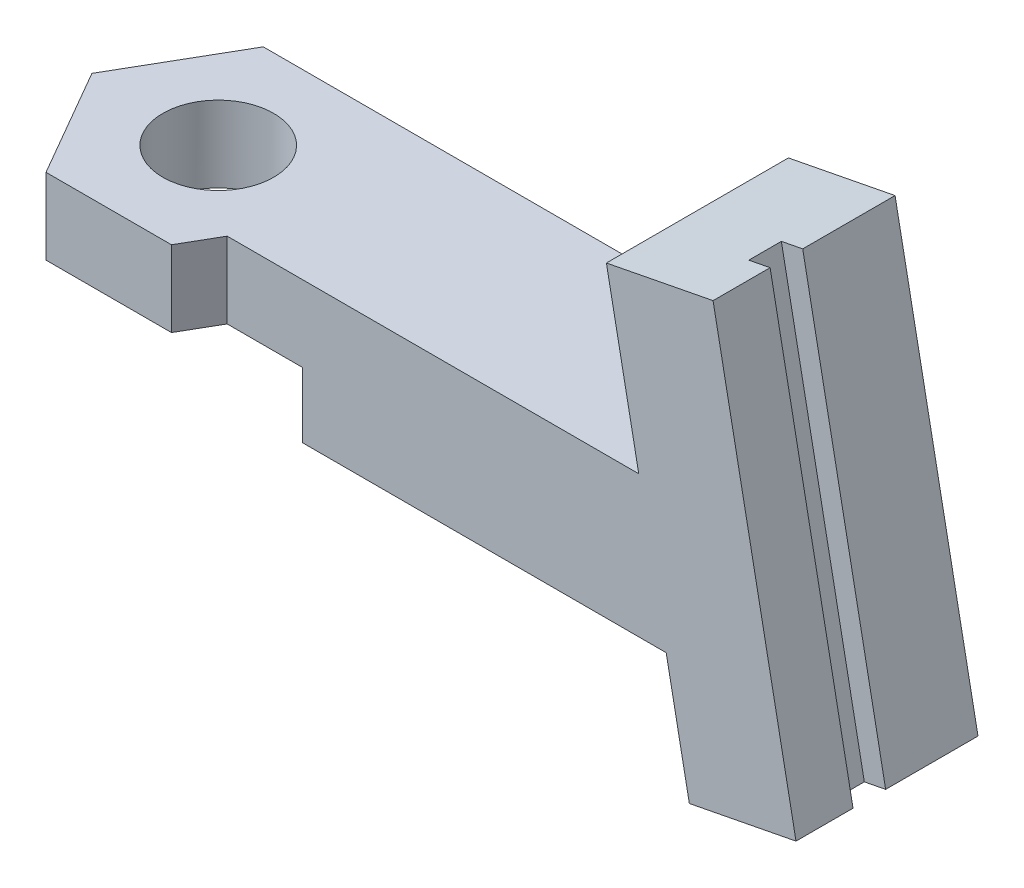
ISO-10303-21;
HEADER;
FILE_DESCRIPTION(('STEP AP214'),'2;1');
FILE_NAME('part.step','',(''),(''),'','','');
FILE_SCHEMA(('AUTOMOTIVE_DESIGN { 1 0 10303 214 1 1 1 1 }'));
ENDSEC;
DATA;
#1=APPLICATION_CONTEXT('core data for automotive mechanical design processes');
#2=APPLICATION_PROTOCOL_DEFINITION('international standard','automotive_design',2000,#1);
#3=PRODUCT_CONTEXT('',#1,'mechanical');
#4=PRODUCT('Part','Part','',(#3));
#5=PRODUCT_RELATED_PRODUCT_CATEGORY('part','',(#4));
#6=PRODUCT_DEFINITION_FORMATION('','',#4);
#7=PRODUCT_DEFINITION_CONTEXT('part definition',#1,'design');
#8=PRODUCT_DEFINITION('design','',#6,#7);
#9=PRODUCT_DEFINITION_SHAPE('','',#8);
#10=(LENGTH_UNIT() NAMED_UNIT(*) SI_UNIT(.MILLI.,.METRE.));
#11=(NAMED_UNIT(*) PLANE_ANGLE_UNIT() SI_UNIT($,.RADIAN.));
#12=(NAMED_UNIT(*) SI_UNIT($,.STERADIAN.) SOLID_ANGLE_UNIT());
#13=UNCERTAINTY_MEASURE_WITH_UNIT(LENGTH_MEASURE(1.E-05),#10,'distance_accuracy_value','');
#14=(GEOMETRIC_REPRESENTATION_CONTEXT(3) GLOBAL_UNCERTAINTY_ASSIGNED_CONTEXT((#13)) GLOBAL_UNIT_ASSIGNED_CONTEXT((#10,
#11,#12)) REPRESENTATION_CONTEXT('',''));
#15=CARTESIAN_POINT('',(0.,0.,0.));
#16=DIRECTION('',(0.,0.,1.));
#17=DIRECTION('',(1.,0.,0.));
#18=AXIS2_PLACEMENT_3D('',#15,#16,#17);
#19=CARTESIAN_POINT('',(2.88675134594813,-15.2752523165195,8.375));
#20=DIRECTION('',(0.866025403784439,0.,0.5));
#21=DIRECTION('',(0.5,0.,-0.866025403784439));
#22=AXIS2_PLACEMENT_3D('',#19,#20,#21);
#23=PLANE('',#22);
#24=DIRECTION('',(0.,1.,0.));
#25=VECTOR('',#24,1.);
#26=CARTESIAN_POINT('',(2.88675134594813,-15.2752523165195,8.375));
#27=LINE('',#26,#25);
#28=CARTESIAN_POINT('',(2.88675134594813,3.,8.375));
#29=VERTEX_POINT('',#28);
#30=CARTESIAN_POINT('',(2.88675134594813,6.5,8.375));
#31=VERTEX_POINT('',#30);
#32=EDGE_CURVE('E241',#29,#31,#27,.T.);
#33=ORIENTED_EDGE('',*,*,#32,.F.);
#34=DIRECTION('',(0.5,0.,-0.866025403784439));
#35=VECTOR('',#34,1.);
#36=CARTESIAN_POINT('',(2.88675134594813,3.,8.375));
#37=LINE('',#36,#35);
#38=CARTESIAN_POINT('',(3.82494553338127,3.,6.75));
#39=VERTEX_POINT('',#38);
#40=EDGE_CURVE('E195',#29,#39,#37,.T.);
#41=ORIENTED_EDGE('',*,*,#40,.T.);
#42=DIRECTION('',(0.,-1.,0.));
#43=VECTOR('',#42,1.);
#44=CARTESIAN_POINT('',(3.82494553338127,6.5,6.75));
#45=LINE('',#44,#43);
#46=CARTESIAN_POINT('',(3.82494553338127,6.5,6.75));
#47=VERTEX_POINT('',#46);
#48=EDGE_CURVE('E223',#47,#39,#45,.T.);
#49=ORIENTED_EDGE('',*,*,#48,.F.);
#50=DIRECTION('',(0.5,0.,-0.866025403784439));
#51=VECTOR('',#50,1.);
#52=CARTESIAN_POINT('',(2.88675134594813,6.5,8.375));
#53=LINE('',#52,#51);
#54=EDGE_CURVE('E233',#31,#47,#53,.T.);
#55=ORIENTED_EDGE('',*,*,#54,.F.);
#56=EDGE_LOOP('',(#33,#41,#49,#55));
#57=FACE_BOUND('',#56,.T.);
#58=ADVANCED_FACE('F36',(#57),#23,.T.);
#59=CARTESIAN_POINT('',(-2.88675134594813,-15.2752523165195,-1.625));
#60=DIRECTION('',(-0.866025403784439,0.,-0.5));
#61=DIRECTION('',(-0.5,0.,0.866025403784439));
#62=AXIS2_PLACEMENT_3D('',#59,#60,#61);
#63=PLANE('',#62);
#64=DIRECTION('',(0.,1.,0.));
#65=VECTOR('',#64,1.);
#66=CARTESIAN_POINT('',(-2.88675134594813,-15.2752523165195,-1.625));
#67=LINE('',#66,#65);
#68=CARTESIAN_POINT('',(-2.88675134594813,3.,-1.625));
#69=VERTEX_POINT('',#68);
#70=CARTESIAN_POINT('',(-2.88675134594813,6.5,-1.625));
#71=VERTEX_POINT('',#70);
#72=EDGE_CURVE('E224',#69,#71,#67,.T.);
#73=ORIENTED_EDGE('',*,*,#72,.F.);
#74=DIRECTION('',(-0.5,0.,0.866025403784439));
#75=VECTOR('',#74,1.);
#76=CARTESIAN_POINT('',(-2.88675134594813,3.,-1.625));
#77=LINE('',#76,#75);
#78=CARTESIAN_POINT('',(-5.77350269189626,3.,3.375));
#79=VERTEX_POINT('',#78);
#80=EDGE_CURVE('E192',#69,#79,#77,.T.);
#81=ORIENTED_EDGE('',*,*,#80,.T.);
#82=DIRECTION('',(0.,1.,0.));
#83=VECTOR('',#82,1.);
#84=CARTESIAN_POINT('',(-5.77350269189626,-15.2752523165195,3.375));
#85=LINE('',#84,#83);
#86=CARTESIAN_POINT('',(-5.77350269189626,6.5,3.375));
#87=VERTEX_POINT('',#86);
#88=EDGE_CURVE('E239',#79,#87,#85,.T.);
#89=ORIENTED_EDGE('',*,*,#88,.T.);
#90=DIRECTION('',(-0.5,0.,0.866025403784439));
#91=VECTOR('',#90,1.);
#92=CARTESIAN_POINT('',(-2.88675134594813,6.5,-1.625));
#93=LINE('',#92,#91);
#94=EDGE_CURVE('E220',#71,#87,#93,.T.);
#95=ORIENTED_EDGE('',*,*,#94,.F.);
#96=EDGE_LOOP('',(#73,#81,#89,#95));
#97=FACE_BOUND('',#96,.T.);
#98=ADVANCED_FACE('F327',(#97),#63,.T.);
#99=CARTESIAN_POINT('',(-2.88675134594813,-15.2752523165195,8.375));
#100=DIRECTION('',(0.,0.,1.));
#101=DIRECTION('',(1.,0.,0.));
#102=AXIS2_PLACEMENT_3D('',#99,#100,#101);
#103=PLANE('',#102);
#104=DIRECTION('',(0.,1.,0.));
#105=VECTOR('',#104,1.);
#106=CARTESIAN_POINT('',(-2.88675134594813,-15.2752523165195,8.375));
#107=LINE('',#106,#105);
#108=CARTESIAN_POINT('',(-2.88675134594813,3.,8.375));
#109=VERTEX_POINT('',#108);
#110=CARTESIAN_POINT('',(-2.88675134594813,6.5,8.375));
#111=VERTEX_POINT('',#110);
#112=EDGE_CURVE('E243',#109,#111,#107,.T.);
#113=ORIENTED_EDGE('',*,*,#112,.F.);
#114=DIRECTION('',(1.,0.,0.));
#115=VECTOR('',#114,1.);
#116=CARTESIAN_POINT('',(-2.88675134594813,3.,8.375));
#117=LINE('',#116,#115);
#118=EDGE_CURVE('E51',#109,#29,#117,.T.);
#119=ORIENTED_EDGE('',*,*,#118,.T.);
#120=ORIENTED_EDGE('',*,*,#32,.T.);
#121=DIRECTION('',(1.,0.,0.));
#122=VECTOR('',#121,1.);
#123=CARTESIAN_POINT('',(-2.88675134594813,6.5,8.375));
#124=LINE('',#123,#122);
#125=EDGE_CURVE('E230',#111,#31,#124,.T.);
#126=ORIENTED_EDGE('',*,*,#125,.F.);
#127=EDGE_LOOP('',(#113,#119,#120,#126));
#128=FACE_BOUND('',#127,.T.);
#129=ADVANCED_FACE('F321',(#128),#103,.T.);
#130=CARTESIAN_POINT('',(-5.77350269189626,-15.2752523165195,3.375));
#131=DIRECTION('',(-0.866025403784438,0.,0.5));
#132=DIRECTION('',(0.5,0.,0.866025403784439));
#133=AXIS2_PLACEMENT_3D('',#130,#131,#132);
#134=PLANE('',#133);
#135=ORIENTED_EDGE('',*,*,#88,.F.);
#136=DIRECTION('',(0.5,0.,0.866025403784439));
#137=VECTOR('',#136,1.);
#138=CARTESIAN_POINT('',(-5.77350269189626,3.,3.375));
#139=LINE('',#138,#137);
#140=EDGE_CURVE('E189',#79,#109,#139,.T.);
#141=ORIENTED_EDGE('',*,*,#140,.T.);
#142=ORIENTED_EDGE('',*,*,#112,.T.);
#143=DIRECTION('',(0.5,0.,0.866025403784439));
#144=VECTOR('',#143,1.);
#145=CARTESIAN_POINT('',(-5.77350269189626,6.5,3.375));
#146=LINE('',#145,#144);
#147=EDGE_CURVE('E227',#87,#111,#146,.T.);
#148=ORIENTED_EDGE('',*,*,#147,.F.);
#149=EDGE_LOOP('',(#135,#141,#142,#148));
#150=FACE_BOUND('',#149,.T.);
#151=ADVANCED_FACE('F311',(#150),#134,.T.);
#152=CARTESIAN_POINT('',(0.,-3.5,3.33561597332667));
#153=DIRECTION('',(0.,1.,0.));
#154=DIRECTION('',(0.,0.,1.));
#155=AXIS2_PLACEMENT_3D('',#152,#153,#154);
#156=CYLINDRICAL_SURFACE('',#155,2.55);
#157=CARTESIAN_POINT('',(0.,6.5,3.33561597332667));
#158=DIRECTION('',(0.,1.,0.));
#159=DIRECTION('',(0.,0.,1.));
#160=AXIS2_PLACEMENT_3D('',#157,#158,#159);
#161=CIRCLE('',#160,2.55);
#162=CARTESIAN_POINT('',(0.,6.5,5.88561597332667));
#163=VERTEX_POINT('',#162);
#164=EDGE_CURVE('E206',#163,#163,#161,.T.);
#165=ORIENTED_EDGE('',*,*,#164,.T.);
#166=EDGE_LOOP('',(#165));
#167=FACE_BOUND('',#166,.T.);
#168=CARTESIAN_POINT('',(0.,3.,3.33561597332667));
#169=DIRECTION('',(0.,-1.,0.));
#170=DIRECTION('',(0.,0.,-1.));
#171=AXIS2_PLACEMENT_3D('',#168,#169,#170);
#172=CIRCLE('',#171,2.55);
#173=CARTESIAN_POINT('',(0.,3.,0.78561597332667));
#174=VERTEX_POINT('',#173);
#175=EDGE_CURVE('E179',#174,#174,#172,.F.);
#176=ORIENTED_EDGE('',*,*,#175,.F.);
#177=EDGE_LOOP('',(#176));
#178=FACE_BOUND('',#177,.T.);
#179=ADVANCED_FACE('F308',(#167,#178),#156,.F.);
#180=CARTESIAN_POINT('',(21.2756841752307,14.1555211805119,-22.3589203380482));
#181=DIRECTION('',(-0.190808995376549,0.981627183447663,0.));
#182=DIRECTION('',(-0.981627183447663,-0.190808995376549,0.));
#183=AXIS2_PLACEMENT_3D('',#180,#181,#182);
#184=PLANE('',#183);
#185=DIRECTION('',(0.,0.,1.));
#186=VECTOR('',#185,1.);
#187=CARTESIAN_POINT('',(25.2021929090214,14.9187571620179,2.625));
#188=LINE('',#187,#186);
#189=CARTESIAN_POINT('',(25.2021929090214,14.9187571620179,2.625));
#190=VERTEX_POINT('',#189);
#191=CARTESIAN_POINT('',(25.2021929090214,14.9187571620179,4.125));
#192=VERTEX_POINT('',#191);
#193=EDGE_CURVE('E252',#190,#192,#188,.T.);
#194=ORIENTED_EDGE('',*,*,#193,.F.);
#195=DIRECTION('',(0.981627183447664,0.190808995376542,0.));
#196=VECTOR('',#195,1.);
#197=CARTESIAN_POINT('',(25.2021929090214,14.9187571620179,2.625));
#198=LINE('',#197,#196);
#199=CARTESIAN_POINT('',(26.183820092469,15.1095661573944,2.625));
#200=VERTEX_POINT('',#199);
#201=EDGE_CURVE('E247',#190,#200,#198,.T.);
#202=ORIENTED_EDGE('',*,*,#201,.T.);
#203=DIRECTION('',(0.,0.,1.));
#204=VECTOR('',#203,1.);
#205=CARTESIAN_POINT('',(26.183820092469,15.1095661573946,-22.3589203380482));
#206=LINE('',#205,#204);
#207=CARTESIAN_POINT('',(26.183820092469,15.1095661573946,-1.62500000000001));
#208=VERTEX_POINT('',#207);
#209=EDGE_CURVE('E282',#208,#200,#206,.T.);
#210=ORIENTED_EDGE('',*,*,#209,.F.);
#211=DIRECTION('',(0.981627183447663,0.190808995376549,0.));
#212=VECTOR('',#211,1.);
#213=CARTESIAN_POINT('',(26.183820092469,15.1095661573946,-1.62500000000001));
#214=LINE('',#213,#212);
#215=CARTESIAN_POINT('',(21.2756841752307,14.1555211805119,-1.625));
#216=VERTEX_POINT('',#215);
#217=EDGE_CURVE('E213',#216,#208,#214,.T.);
#218=ORIENTED_EDGE('',*,*,#217,.F.);
#219=DIRECTION('',(0.,0.,1.));
#220=VECTOR('',#219,1.);
#221=CARTESIAN_POINT('',(21.2756841752307,14.1555211805119,-22.3589203380482));
#222=LINE('',#221,#220);
#223=CARTESIAN_POINT('',(21.2756841752307,14.1555211805119,6.75));
#224=VERTEX_POINT('',#223);
#225=EDGE_CURVE('E278',#216,#224,#222,.T.);
#226=ORIENTED_EDGE('',*,*,#225,.T.);
#227=DIRECTION('',(0.981627183447663,0.190808995376549,0.));
#228=VECTOR('',#227,1.);
#229=CARTESIAN_POINT('',(21.2756841752307,14.1555211805119,6.75));
#230=LINE('',#229,#228);
#231=CARTESIAN_POINT('',(26.183820092469,15.1095661573946,6.75000000000001));
#232=VERTEX_POINT('',#231);
#233=EDGE_CURVE('E264',#224,#232,#230,.T.);
#234=ORIENTED_EDGE('',*,*,#233,.T.);
#235=CARTESIAN_POINT('',(26.183820092469,15.1095661573944,4.125));
#236=VERTEX_POINT('',#235);
#237=EDGE_CURVE('E285',#236,#232,#206,.T.);
#238=ORIENTED_EDGE('',*,*,#237,.F.);
#239=DIRECTION('',(0.981627183447664,0.190808995376542,0.));
#240=VECTOR('',#239,1.);
#241=CARTESIAN_POINT('',(25.2021929090214,14.9187571620179,4.125));
#242=LINE('',#241,#240);
#243=EDGE_CURVE('E250',#192,#236,#242,.T.);
#244=ORIENTED_EDGE('',*,*,#243,.F.);
#245=EDGE_LOOP('',(#194,#202,#210,#218,#226,#234,#238,#244));
#246=FACE_BOUND('',#245,.T.);
#247=ADVANCED_FACE('F310',(#246),#184,.T.);
#248=CARTESIAN_POINT('',(26.183820092469,15.1095661573946,-22.3589203380482));
#249=DIRECTION('',(0.981627183447663,0.190808995376549,0.));
#250=DIRECTION('',(-0.190808995376549,0.981627183447663,0.));
#251=AXIS2_PLACEMENT_3D('',#248,#249,#250);
#252=PLANE('',#251);
#253=ORIENTED_EDGE('',*,*,#209,.T.);
#254=DIRECTION('',(-0.190808995376542,0.981627183447665,0.));
#255=VECTOR('',#254,1.);
#256=CARTESIAN_POINT('',(30.5724269861295,-7.46785906190183,2.625));
#257=LINE('',#256,#255);
#258=CARTESIAN_POINT('',(29.9999999999999,-4.52297751155865,2.625));
#259=VERTEX_POINT('',#258);
#260=EDGE_CURVE('E262',#259,#200,#257,.T.);
#261=ORIENTED_EDGE('',*,*,#260,.F.);
#262=DIRECTION('',(0.,0.,1.));
#263=VECTOR('',#262,1.);
#264=CARTESIAN_POINT('',(30.,-4.52297751155863,-22.3589203380482));
#265=LINE('',#264,#263);
#266=CARTESIAN_POINT('',(30.,-4.52297751155863,-1.62500000000001));
#267=VERTEX_POINT('',#266);
#268=EDGE_CURVE('E286',#267,#259,#265,.T.);
#269=ORIENTED_EDGE('',*,*,#268,.F.);
#270=DIRECTION('',(0.190808995376549,-0.981627183447663,0.));
#271=VECTOR('',#270,1.);
#272=CARTESIAN_POINT('',(30.,-4.52297751155863,-1.62500000000001));
#273=LINE('',#272,#271);
#274=EDGE_CURVE('E210',#208,#267,#273,.T.);
#275=ORIENTED_EDGE('',*,*,#274,.F.);
#276=EDGE_LOOP('',(#253,#261,#269,#275));
#277=FACE_BOUND('',#276,.T.);
#278=ADVANCED_FACE('F318',(#277),#252,.T.);
#279=CARTESIAN_POINT('',(30.,-4.52297751155863,-22.3589203380482));
#280=DIRECTION('',(0.190808995376549,-0.981627183447663,0.));
#281=DIRECTION('',(0.981627183447663,0.190808995376549,0.));
#282=AXIS2_PLACEMENT_3D('',#279,#280,#281);
#283=PLANE('',#282);
#284=ORIENTED_EDGE('',*,*,#268,.T.);
#285=DIRECTION('',(-0.981627183447663,-0.190808995376549,0.));
#286=VECTOR('',#285,1.);
#287=CARTESIAN_POINT('',(30.,-4.52297751155863,2.625));
#288=LINE('',#287,#286);
#289=CARTESIAN_POINT('',(29.0183728165522,-4.7137865069352,2.625));
#290=VERTEX_POINT('',#289);
#291=EDGE_CURVE('E44',#259,#290,#288,.T.);
#292=ORIENTED_EDGE('',*,*,#291,.T.);
#293=DIRECTION('',(0.,0.,-1.));
#294=VECTOR('',#293,1.);
#295=CARTESIAN_POINT('',(29.0183728165522,-4.7137865069352,-22.3589203380482));
#296=LINE('',#295,#294);
#297=CARTESIAN_POINT('',(29.0183728165522,-4.7137865069352,4.125));
#298=VERTEX_POINT('',#297);
#299=EDGE_CURVE('E299',#298,#290,#296,.T.);
#300=ORIENTED_EDGE('',*,*,#299,.F.);
#301=DIRECTION('',(-0.981627183447663,-0.190808995376549,0.));
#302=VECTOR('',#301,1.);
#303=CARTESIAN_POINT('',(30.,-4.52297751155862,4.125));
#304=LINE('',#303,#302);
#305=CARTESIAN_POINT('',(29.9999999999999,-4.52297751155865,4.125));
#306=VERTEX_POINT('',#305);
#307=EDGE_CURVE('E301',#306,#298,#304,.T.);
#308=ORIENTED_EDGE('',*,*,#307,.F.);
#309=CARTESIAN_POINT('',(30.,-4.52297751155863,6.75));
#310=VERTEX_POINT('',#309);
#311=EDGE_CURVE('E289',#306,#310,#265,.T.);
#312=ORIENTED_EDGE('',*,*,#311,.T.);
#313=DIRECTION('',(-0.981627183447663,-0.190808995376549,0.));
#314=VECTOR('',#313,1.);
#315=CARTESIAN_POINT('',(30.,-4.52297751155863,6.75));
#316=LINE('',#315,#314);
#317=CARTESIAN_POINT('',(25.0918640827617,-5.47702248844137,6.75));
#318=VERTEX_POINT('',#317);
#319=EDGE_CURVE('E268',#310,#318,#316,.T.);
#320=ORIENTED_EDGE('',*,*,#319,.T.);
#321=DIRECTION('',(0.,0.,1.));
#322=VECTOR('',#321,1.);
#323=CARTESIAN_POINT('',(25.0918640827617,-5.47702248844137,-22.3589203380482));
#324=LINE('',#323,#322);
#325=CARTESIAN_POINT('',(25.0918640827617,-5.47702248844137,-1.62500000000001));
#326=VERTEX_POINT('',#325);
#327=EDGE_CURVE('E275',#326,#318,#324,.T.);
#328=ORIENTED_EDGE('',*,*,#327,.F.);
#329=DIRECTION('',(-0.981627183447663,-0.190808995376549,0.));
#330=VECTOR('',#329,1.);
#331=CARTESIAN_POINT('',(25.0918640827617,-5.47702248844137,-1.62500000000001));
#332=LINE('',#331,#330);
#333=EDGE_CURVE('E207',#267,#326,#332,.T.);
#334=ORIENTED_EDGE('',*,*,#333,.F.);
#335=EDGE_LOOP('',(#284,#292,#300,#308,#312,#320,#328,#334));
#336=FACE_BOUND('',#335,.T.);
#337=ADVANCED_FACE('F358',(#336),#283,.T.);
#338=CARTESIAN_POINT('',(0.,6.5,6.75));
#339=DIRECTION('',(0.,0.,-1.));
#340=DIRECTION('',(-1.,0.,0.));
#341=AXIS2_PLACEMENT_3D('',#338,#339,#340);
#342=PLANE('',#341);
#343=DIRECTION('',(-1.,0.,0.));
#344=VECTOR('',#343,1.);
#345=CARTESIAN_POINT('',(0.,3.,6.75));
#346=LINE('',#345,#344);
#347=CARTESIAN_POINT('',(7.28904714851902,3.,6.75));
#348=VERTEX_POINT('',#347);
#349=EDGE_CURVE('E198',#348,#39,#346,.T.);
#350=ORIENTED_EDGE('',*,*,#349,.F.);
#351=DIRECTION('',(0.,-1.,0.));
#352=VECTOR('',#351,1.);
#353=CARTESIAN_POINT('',(7.28904714851903,6.5,6.75));
#354=LINE('',#353,#352);
#355=CARTESIAN_POINT('',(7.28904714851902,0.,6.75));
#356=VERTEX_POINT('',#355);
#357=EDGE_CURVE('E183',#348,#356,#354,.T.);
#358=ORIENTED_EDGE('',*,*,#357,.T.);
#359=DIRECTION('',(1.,0.,0.));
#360=VECTOR('',#359,1.);
#361=CARTESIAN_POINT('',(0.,0.,6.75));
#362=LINE('',#361,#360);
#363=CARTESIAN_POINT('',(24.0272387583042,0.,6.75));
#364=VERTEX_POINT('',#363);
#365=EDGE_CURVE('E293',#356,#364,#362,.T.);
#366=ORIENTED_EDGE('',*,*,#365,.T.);
#367=DIRECTION('',(-0.190808995376549,0.981627183447663,0.));
#368=VECTOR('',#367,1.);
#369=CARTESIAN_POINT('',(25.0918640827617,-5.47702248844137,6.75));
#370=LINE('',#369,#368);
#371=EDGE_CURVE('E272',#318,#364,#370,.T.);
#372=ORIENTED_EDGE('',*,*,#371,.F.);
#373=ORIENTED_EDGE('',*,*,#319,.F.);
#374=DIRECTION('',(0.190808995376549,-0.981627183447663,0.));
#375=VECTOR('',#374,1.);
#376=CARTESIAN_POINT('',(26.183820092469,15.1095661573946,6.75));
#377=LINE('',#376,#375);
#378=EDGE_CURVE('E265',#232,#310,#377,.T.);
#379=ORIENTED_EDGE('',*,*,#378,.F.);
#380=ORIENTED_EDGE('',*,*,#233,.F.);
#381=CARTESIAN_POINT('',(22.763766748909,6.5,6.75));
#382=VERTEX_POINT('',#381);
#383=EDGE_CURVE('E271',#382,#224,#370,.T.);
#384=ORIENTED_EDGE('',*,*,#383,.F.);
#385=DIRECTION('',(1.,0.,0.));
#386=VECTOR('',#385,1.);
#387=CARTESIAN_POINT('',(0.,6.5,6.75));
#388=LINE('',#387,#386);
#389=EDGE_CURVE('E59',#47,#382,#388,.T.);
#390=ORIENTED_EDGE('',*,*,#389,.F.);
#391=ORIENTED_EDGE('',*,*,#48,.T.);
#392=EDGE_LOOP('',(#350,#358,#366,#372,#373,#379,#380,#384,#390,#391));
#393=FACE_BOUND('',#392,.T.);
#394=ADVANCED_FACE('F38',(#393),#342,.F.);
#395=CARTESIAN_POINT('',(0.,6.5,0.));
#396=DIRECTION('',(0.,1.,0.));
#397=DIRECTION('',(0.,0.,1.));
#398=AXIS2_PLACEMENT_3D('',#395,#396,#397);
#399=PLANE('',#398);
#400=DIRECTION('',(0.,0.,1.));
#401=VECTOR('',#400,1.);
#402=CARTESIAN_POINT('',(22.763766748909,6.5,0.));
#403=LINE('',#402,#401);
#404=CARTESIAN_POINT('',(22.763766748909,6.5,-1.625));
#405=VERTEX_POINT('',#404);
#406=EDGE_CURVE('E281',#405,#382,#403,.T.);
#407=ORIENTED_EDGE('',*,*,#406,.F.);
#408=DIRECTION('',(-1.,0.,0.));
#409=VECTOR('',#408,1.);
#410=CARTESIAN_POINT('',(2.88675134594812,6.5,-1.625));
#411=LINE('',#410,#409);
#412=EDGE_CURVE('E236',#405,#71,#411,.T.);
#413=ORIENTED_EDGE('',*,*,#412,.T.);
#414=ORIENTED_EDGE('',*,*,#94,.T.);
#415=ORIENTED_EDGE('',*,*,#147,.T.);
#416=ORIENTED_EDGE('',*,*,#125,.T.);
#417=ORIENTED_EDGE('',*,*,#54,.T.);
#418=ORIENTED_EDGE('',*,*,#389,.T.);
#419=EDGE_LOOP('',(#407,#413,#414,#415,#416,#417,#418));
#420=FACE_BOUND('',#419,.T.);
#421=ORIENTED_EDGE('',*,*,#164,.F.);
#422=EDGE_LOOP('',(#421));
#423=FACE_BOUND('',#422,.T.);
#424=ADVANCED_FACE('F366',(#420,#423),#399,.T.);
#425=CARTESIAN_POINT('',(0.,0.,0.));
#426=DIRECTION('',(0.,1.,0.));
#427=DIRECTION('',(0.,0.,1.));
#428=AXIS2_PLACEMENT_3D('',#425,#426,#427);
#429=PLANE('',#428);
#430=ORIENTED_EDGE('',*,*,#365,.F.);
#431=DIRECTION('',(-0.5,0.,0.866025403784439));
#432=VECTOR('',#431,1.);
#433=CARTESIAN_POINT('',(9.23760430703401,0.,3.375));
#434=LINE('',#433,#432);
#435=CARTESIAN_POINT('',(9.23760430703401,0.,3.375));
#436=VERTEX_POINT('',#435);
#437=EDGE_CURVE('E185',#436,#356,#434,.T.);
#438=ORIENTED_EDGE('',*,*,#437,.F.);
#439=DIRECTION('',(0.5,0.,0.866025403784439));
#440=VECTOR('',#439,1.);
#441=CARTESIAN_POINT('',(4.61880215351701,0.,-4.625));
#442=LINE('',#441,#440);
#443=CARTESIAN_POINT('',(6.35085296108588,0.,-1.625));
#444=VERTEX_POINT('',#443);
#445=EDGE_CURVE('E176',#444,#436,#442,.T.);
#446=ORIENTED_EDGE('',*,*,#445,.F.);
#447=DIRECTION('',(1.,0.,0.));
#448=VECTOR('',#447,1.);
#449=CARTESIAN_POINT('',(2.88675134594812,0.,-1.625));
#450=LINE('',#449,#448);
#451=CARTESIAN_POINT('',(24.0272387583042,0.,-1.625));
#452=VERTEX_POINT('',#451);
#453=EDGE_CURVE('E221',#444,#452,#450,.T.);
#454=ORIENTED_EDGE('',*,*,#453,.T.);
#455=DIRECTION('',(0.,0.,1.));
#456=VECTOR('',#455,1.);
#457=CARTESIAN_POINT('',(24.0272387583042,0.,0.));
#458=LINE('',#457,#456);
#459=EDGE_CURVE('E295',#452,#364,#458,.T.);
#460=ORIENTED_EDGE('',*,*,#459,.T.);
#461=EDGE_LOOP('',(#430,#438,#446,#454,#460));
#462=FACE_BOUND('',#461,.T.);
#463=ADVANCED_FACE('F368',(#462),#429,.F.);
#464=CARTESIAN_POINT('',(25.0918640827617,-5.47702248844137,-22.3589203380482));
#465=DIRECTION('',(-0.981627183447663,-0.190808995376549,0.));
#466=DIRECTION('',(0.190808995376549,-0.981627183447663,0.));
#467=AXIS2_PLACEMENT_3D('',#464,#465,#466);
#468=PLANE('',#467);
#469=ORIENTED_EDGE('',*,*,#459,.F.);
#470=DIRECTION('',(-0.190808995376549,0.981627183447663,0.));
#471=VECTOR('',#470,1.);
#472=CARTESIAN_POINT('',(24.0272387583042,0.,-1.625));
#473=LINE('',#472,#471);
#474=EDGE_CURVE('E203',#326,#452,#473,.T.);
#475=ORIENTED_EDGE('',*,*,#474,.F.);
#476=ORIENTED_EDGE('',*,*,#327,.T.);
#477=ORIENTED_EDGE('',*,*,#371,.T.);
#478=EDGE_LOOP('',(#469,#475,#476,#477));
#479=FACE_BOUND('',#478,.T.);
#480=ADVANCED_FACE('F364',(#479),#468,.T.);
#481=ORIENTED_EDGE('',*,*,#225,.F.);
#482=DIRECTION('',(-0.190808995376549,0.981627183447663,0.));
#483=VECTOR('',#482,1.);
#484=CARTESIAN_POINT('',(21.2756841752307,14.1555211805119,-1.625));
#485=LINE('',#484,#483);
#486=EDGE_CURVE('E202',#405,#216,#485,.T.);
#487=ORIENTED_EDGE('',*,*,#486,.F.);
#488=ORIENTED_EDGE('',*,*,#406,.T.);
#489=ORIENTED_EDGE('',*,*,#383,.T.);
#490=EDGE_LOOP('',(#481,#487,#488,#489));
#491=FACE_BOUND('',#490,.T.);
#492=ADVANCED_FACE('F356',(#491),#468,.T.);
#493=DIRECTION('',(-0.190808995376542,0.981627183447665,0.));
#494=VECTOR('',#493,1.);
#495=CARTESIAN_POINT('',(30.5724269861295,-7.46785906190183,4.125));
#496=LINE('',#495,#494);
#497=EDGE_CURVE('E259',#306,#236,#496,.T.);
#498=ORIENTED_EDGE('',*,*,#497,.T.);
#499=ORIENTED_EDGE('',*,*,#237,.T.);
#500=ORIENTED_EDGE('',*,*,#378,.T.);
#501=ORIENTED_EDGE('',*,*,#311,.F.);
#502=EDGE_LOOP('',(#498,#499,#500,#501));
#503=FACE_BOUND('',#502,.T.);
#504=ADVANCED_FACE('F351',(#503),#252,.T.);
#505=CARTESIAN_POINT('',(29.5907998026819,-7.65866805727838,2.625));
#506=DIRECTION('',(0.,0.,1.));
#507=DIRECTION('',(1.,0.,0.));
#508=AXIS2_PLACEMENT_3D('',#505,#506,#507);
#509=PLANE('',#508);
#510=ORIENTED_EDGE('',*,*,#260,.T.);
#511=ORIENTED_EDGE('',*,*,#201,.F.);
#512=DIRECTION('',(-0.190808995376542,0.981627183447665,0.));
#513=VECTOR('',#512,1.);
#514=CARTESIAN_POINT('',(29.5907998026819,-7.65866805727838,2.625));
#515=LINE('',#514,#513);
#516=EDGE_CURVE('E255',#290,#190,#515,.T.);
#517=ORIENTED_EDGE('',*,*,#516,.F.);
#518=ORIENTED_EDGE('',*,*,#291,.F.);
#519=EDGE_LOOP('',(#510,#511,#517,#518));
#520=FACE_BOUND('',#519,.T.);
#521=ADVANCED_FACE('F348',(#520),#509,.T.);
#522=CARTESIAN_POINT('',(29.5907998026819,-7.65866805727838,4.125));
#523=DIRECTION('',(0.,0.,1.));
#524=DIRECTION('',(1.,0.,0.));
#525=AXIS2_PLACEMENT_3D('',#522,#523,#524);
#526=PLANE('',#525);
#527=ORIENTED_EDGE('',*,*,#307,.T.);
#528=DIRECTION('',(-0.190808995376542,0.981627183447665,0.));
#529=VECTOR('',#528,1.);
#530=CARTESIAN_POINT('',(29.5907998026819,-7.65866805727838,4.125));
#531=LINE('',#530,#529);
#532=EDGE_CURVE('E257',#298,#192,#531,.T.);
#533=ORIENTED_EDGE('',*,*,#532,.T.);
#534=ORIENTED_EDGE('',*,*,#243,.T.);
#535=ORIENTED_EDGE('',*,*,#497,.F.);
#536=EDGE_LOOP('',(#527,#533,#534,#535));
#537=FACE_BOUND('',#536,.T.);
#538=ADVANCED_FACE('F344',(#537),#526,.F.);
#539=CARTESIAN_POINT('',(29.5907998026819,-7.65866805727838,2.625));
#540=DIRECTION('',(-0.981627183447665,-0.190808995376542,0.));
#541=DIRECTION('',(0.190808995376542,-0.981627183447665,0.));
#542=AXIS2_PLACEMENT_3D('',#539,#540,#541);
#543=PLANE('',#542);
#544=ORIENTED_EDGE('',*,*,#299,.T.);
#545=ORIENTED_EDGE('',*,*,#516,.T.);
#546=ORIENTED_EDGE('',*,*,#193,.T.);
#547=ORIENTED_EDGE('',*,*,#532,.F.);
#548=EDGE_LOOP('',(#544,#545,#546,#547));
#549=FACE_BOUND('',#548,.T.);
#550=ADVANCED_FACE('F341',(#549),#543,.F.);
#551=CARTESIAN_POINT('',(2.88675134594812,-15.2752523165195,-1.625));
#552=DIRECTION('',(0.,0.,-1.));
#553=DIRECTION('',(-1.,0.,0.));
#554=AXIS2_PLACEMENT_3D('',#551,#552,#553);
#555=PLANE('',#554);
#556=DIRECTION('',(0.,-1.,0.));
#557=VECTOR('',#556,1.);
#558=CARTESIAN_POINT('',(6.35085296108588,-15.2752523165195,-1.625));
#559=LINE('',#558,#557);
#560=CARTESIAN_POINT('',(6.35085296108588,3.,-1.625));
#561=VERTEX_POINT('',#560);
#562=EDGE_CURVE('E11',#561,#444,#559,.T.);
#563=ORIENTED_EDGE('',*,*,#562,.F.);
#564=DIRECTION('',(-1.,0.,0.));
#565=VECTOR('',#564,1.);
#566=CARTESIAN_POINT('',(2.88675134594812,3.,-1.625));
#567=LINE('',#566,#565);
#568=EDGE_CURVE('E168',#561,#69,#567,.T.);
#569=ORIENTED_EDGE('',*,*,#568,.T.);
#570=ORIENTED_EDGE('',*,*,#72,.T.);
#571=ORIENTED_EDGE('',*,*,#412,.F.);
#572=ORIENTED_EDGE('',*,*,#486,.T.);
#573=ORIENTED_EDGE('',*,*,#217,.T.);
#574=ORIENTED_EDGE('',*,*,#274,.T.);
#575=ORIENTED_EDGE('',*,*,#333,.T.);
#576=ORIENTED_EDGE('',*,*,#474,.T.);
#577=ORIENTED_EDGE('',*,*,#453,.F.);
#578=EDGE_LOOP('',(#563,#569,#570,#571,#572,#573,#574,#575,#576,#577));
#579=FACE_BOUND('',#578,.T.);
#580=ADVANCED_FACE('F337',(#579),#555,.T.);
#581=CARTESIAN_POINT('',(9.23760430703401,3.,3.375));
#582=DIRECTION('',(0.866025403784439,0.,0.5));
#583=DIRECTION('',(0.5,0.,-0.866025403784439));
#584=AXIS2_PLACEMENT_3D('',#581,#582,#583);
#585=PLANE('',#584);
#586=DIRECTION('',(-0.5,0.,0.866025403784439));
#587=VECTOR('',#586,1.);
#588=CARTESIAN_POINT('',(9.23760430703401,3.,3.375));
#589=LINE('',#588,#587);
#590=CARTESIAN_POINT('',(9.23760430703401,3.,3.375));
#591=VERTEX_POINT('',#590);
#592=EDGE_CURVE('E165',#591,#348,#589,.T.);
#593=ORIENTED_EDGE('',*,*,#592,.F.);
#594=DIRECTION('',(0.,-1.,0.));
#595=VECTOR('',#594,1.);
#596=CARTESIAN_POINT('',(9.23760430703401,3.,3.375));
#597=LINE('',#596,#595);
#598=EDGE_CURVE('E171',#591,#436,#597,.T.);
#599=ORIENTED_EDGE('',*,*,#598,.T.);
#600=ORIENTED_EDGE('',*,*,#437,.T.);
#601=ORIENTED_EDGE('',*,*,#357,.F.);
#602=EDGE_LOOP('',(#593,#599,#600,#601));
#603=FACE_BOUND('',#602,.T.);
#604=ADVANCED_FACE('F181',(#603),#585,.F.);
#605=CARTESIAN_POINT('',(0.,3.,0.));
#606=DIRECTION('',(0.,-1.,0.));
#607=DIRECTION('',(0.,0.,-1.));
#608=AXIS2_PLACEMENT_3D('',#605,#606,#607);
#609=PLANE('',#608);
#610=DIRECTION('',(0.5,0.,0.866025403784439));
#611=VECTOR('',#610,1.);
#612=CARTESIAN_POINT('',(4.61880215351701,3.,-4.625));
#613=LINE('',#612,#611);
#614=EDGE_CURVE('E160',#561,#591,#613,.T.);
#615=ORIENTED_EDGE('',*,*,#614,.T.);
#616=ORIENTED_EDGE('',*,*,#592,.T.);
#617=ORIENTED_EDGE('',*,*,#349,.T.);
#618=ORIENTED_EDGE('',*,*,#40,.F.);
#619=ORIENTED_EDGE('',*,*,#118,.F.);
#620=ORIENTED_EDGE('',*,*,#140,.F.);
#621=ORIENTED_EDGE('',*,*,#80,.F.);
#622=ORIENTED_EDGE('',*,*,#568,.F.);
#623=EDGE_LOOP('',(#615,#616,#617,#618,#619,#620,#621,#622));
#624=FACE_BOUND('',#623,.T.);
#625=ORIENTED_EDGE('',*,*,#175,.T.);
#626=EDGE_LOOP('',(#625));
#627=FACE_BOUND('',#626,.T.);
#628=ADVANCED_FACE('F162',(#624,#627),#609,.T.);
#629=CARTESIAN_POINT('',(4.61880215351701,3.,-4.625));
#630=DIRECTION('',(0.866025403784439,0.,-0.5));
#631=DIRECTION('',(-0.5,0.,-0.866025403784439));
#632=AXIS2_PLACEMENT_3D('',#629,#630,#631);
#633=PLANE('',#632);
#634=ORIENTED_EDGE('',*,*,#562,.T.);
#635=ORIENTED_EDGE('',*,*,#445,.T.);
#636=ORIENTED_EDGE('',*,*,#598,.F.);
#637=ORIENTED_EDGE('',*,*,#614,.F.);
#638=EDGE_LOOP('',(#634,#635,#636,#637));
#639=FACE_BOUND('',#638,.T.);
#640=ADVANCED_FACE('F174',(#639),#633,.F.);
#641=CLOSED_SHELL('',(#58,#98,#129,#151,#179,#247,#278,#337,#394,#424,#463,#480,#492,#504,#521,
#538,#550,#580,#604,#628,#640));
#642=MANIFOLD_SOLID_BREP('B2',#641);
#643=ADVANCED_BREP_SHAPE_REPRESENTATION('',(#18,#642),#14);
#644=SHAPE_DEFINITION_REPRESENTATION(#9,#643);
ENDSEC;
END-ISO-10303-21;
